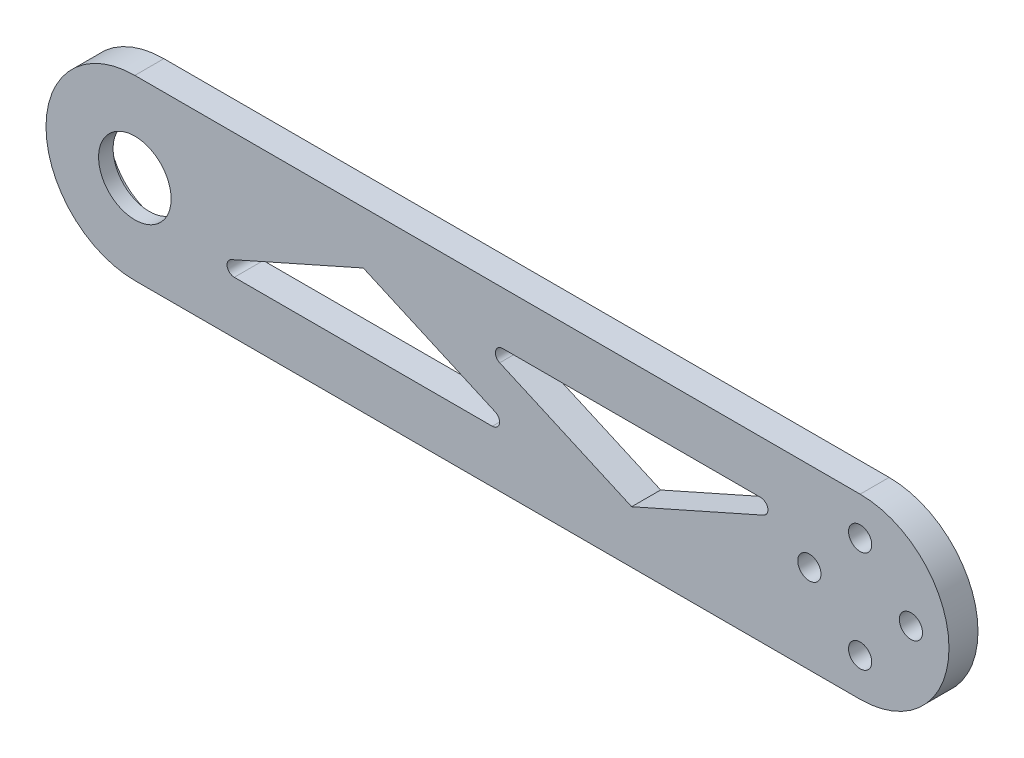
ISO-10303-21;
HEADER;
FILE_DESCRIPTION(('STEP AP214'),'2;1');
FILE_NAME('part.step','',(''),(''),'','','');
FILE_SCHEMA(('AUTOMOTIVE_DESIGN { 1 0 10303 214 1 1 1 1 }'));
ENDSEC;
DATA;
#1=APPLICATION_CONTEXT('core data for automotive mechanical design processes');
#2=APPLICATION_PROTOCOL_DEFINITION('international standard','automotive_design',2000,#1);
#3=PRODUCT_CONTEXT('',#1,'mechanical');
#4=PRODUCT('Part','Part','',(#3));
#5=PRODUCT_RELATED_PRODUCT_CATEGORY('part','',(#4));
#6=PRODUCT_DEFINITION_FORMATION('','',#4);
#7=PRODUCT_DEFINITION_CONTEXT('part definition',#1,'design');
#8=PRODUCT_DEFINITION('design','',#6,#7);
#9=PRODUCT_DEFINITION_SHAPE('','',#8);
#10=(LENGTH_UNIT() NAMED_UNIT(*) SI_UNIT(.MILLI.,.METRE.));
#11=(NAMED_UNIT(*) PLANE_ANGLE_UNIT() SI_UNIT($,.RADIAN.));
#12=(NAMED_UNIT(*) SI_UNIT($,.STERADIAN.) SOLID_ANGLE_UNIT());
#13=UNCERTAINTY_MEASURE_WITH_UNIT(LENGTH_MEASURE(1.E-05),#10,'distance_accuracy_value','');
#14=(GEOMETRIC_REPRESENTATION_CONTEXT(3) GLOBAL_UNCERTAINTY_ASSIGNED_CONTEXT((#13)) GLOBAL_UNIT_ASSIGNED_CONTEXT((#10,
#11,#12)) REPRESENTATION_CONTEXT('',''));
#15=CARTESIAN_POINT('',(0.,0.,0.));
#16=DIRECTION('',(0.,0.,1.));
#17=DIRECTION('',(1.,0.,0.));
#18=AXIS2_PLACEMENT_3D('',#15,#16,#17);
#19=CARTESIAN_POINT('',(0.,0.,4.));
#20=DIRECTION('',(0.,0.,1.));
#21=DIRECTION('',(1.,0.,0.));
#22=AXIS2_PLACEMENT_3D('',#19,#20,#21);
#23=PLANE('',#22);
#24=CARTESIAN_POINT('',(86.287785549551,4.,4.));
#25=DIRECTION('',(0.,0.,1.));
#26=DIRECTION('',(-1.,0.,0.));
#27=AXIS2_PLACEMENT_3D('',#24,#25,#26);
#28=CIRCLE('',#27,1.);
#29=CARTESIAN_POINT('',(86.6939240156043,3.08618845137971,4.));
#30=VERTEX_POINT('',#29);
#31=CARTESIAN_POINT('',(86.2877855495509,5.,4.));
#32=VERTEX_POINT('',#31);
#33=EDGE_CURVE('E59',#30,#32,#28,.T.);
#34=ORIENTED_EDGE('',*,*,#33,.F.);
#35=DIRECTION('',(0.913811548620257,0.406138466053448,0.));
#36=VECTOR('',#35,1.);
#37=CARTESIAN_POINT('',(68.5,-5.,4.));
#38=LINE('',#37,#36);
#39=CARTESIAN_POINT('',(68.5,-5.,4.));
#40=VERTEX_POINT('',#39);
#41=EDGE_CURVE('E154',#40,#30,#38,.T.);
#42=ORIENTED_EDGE('',*,*,#41,.F.);
#43=DIRECTION('',(0.913811548620257,-0.406138466053448,0.));
#44=VECTOR('',#43,1.);
#45=CARTESIAN_POINT('',(50.3060759843957,3.08618845137971,4.));
#46=LINE('',#45,#44);
#47=CARTESIAN_POINT('',(50.3060759843957,3.08618845137971,4.));
#48=VERTEX_POINT('',#47);
#49=EDGE_CURVE('E187',#48,#40,#46,.T.);
#50=ORIENTED_EDGE('',*,*,#49,.F.);
#51=CARTESIAN_POINT('',(50.712214450449,4.,4.));
#52=DIRECTION('',(0.,0.,1.));
#53=DIRECTION('',(1.,0.,0.));
#54=AXIS2_PLACEMENT_3D('',#51,#52,#53);
#55=CIRCLE('',#54,1.);
#56=CARTESIAN_POINT('',(50.7122144504491,5.,4.));
#57=VERTEX_POINT('',#56);
#58=EDGE_CURVE('E183',#57,#48,#55,.T.);
#59=ORIENTED_EDGE('',*,*,#58,.F.);
#60=DIRECTION('',(-1.,0.,0.));
#61=VECTOR('',#60,1.);
#62=CARTESIAN_POINT('',(86.2877855495509,5.,4.));
#63=LINE('',#62,#61);
#64=EDGE_CURVE('E175',#32,#57,#63,.T.);
#65=ORIENTED_EDGE('',*,*,#64,.F.);
#66=EDGE_LOOP('',(#34,#42,#50,#59,#65));
#67=FACE_BOUND('',#66,.T.);
#68=DIRECTION('',(-0.913811548620257,0.406138466053448,0.));
#69=VECTOR('',#68,1.);
#70=CARTESIAN_POINT('',(49.6939240156043,-3.08618845137971,4.));
#71=LINE('',#70,#69);
#72=CARTESIAN_POINT('',(49.6939240156043,-3.08618845137971,4.));
#73=VERTEX_POINT('',#72);
#74=CARTESIAN_POINT('',(31.5,5.,4.));
#75=VERTEX_POINT('',#74);
#76=EDGE_CURVE('E67',#73,#75,#71,.T.);
#77=ORIENTED_EDGE('',*,*,#76,.F.);
#78=CARTESIAN_POINT('',(49.287785549551,-4.,4.));
#79=DIRECTION('',(0.,0.,1.));
#80=DIRECTION('',(1.,0.,0.));
#81=AXIS2_PLACEMENT_3D('',#78,#79,#80);
#82=CIRCLE('',#81,1.);
#83=CARTESIAN_POINT('',(49.2877855495509,-5.,4.));
#84=VERTEX_POINT('',#83);
#85=EDGE_CURVE('E232',#84,#73,#82,.T.);
#86=ORIENTED_EDGE('',*,*,#85,.F.);
#87=DIRECTION('',(1.,0.,0.));
#88=VECTOR('',#87,1.);
#89=CARTESIAN_POINT('',(13.7122144504491,-5.,4.));
#90=LINE('',#89,#88);
#91=CARTESIAN_POINT('',(13.7122144504491,-5.,4.));
#92=VERTEX_POINT('',#91);
#93=EDGE_CURVE('E228',#92,#84,#90,.T.);
#94=ORIENTED_EDGE('',*,*,#93,.F.);
#95=CARTESIAN_POINT('',(13.712214450449,-4.,4.));
#96=DIRECTION('',(0.,0.,1.));
#97=DIRECTION('',(1.,0.,0.));
#98=AXIS2_PLACEMENT_3D('',#95,#96,#97);
#99=CIRCLE('',#98,1.);
#100=CARTESIAN_POINT('',(13.3060759843957,-3.08618845137971,4.));
#101=VERTEX_POINT('',#100);
#102=EDGE_CURVE('E224',#101,#92,#99,.T.);
#103=ORIENTED_EDGE('',*,*,#102,.F.);
#104=DIRECTION('',(-0.913811548620257,-0.406138466053448,0.));
#105=VECTOR('',#104,1.);
#106=CARTESIAN_POINT('',(31.5,5.,4.));
#107=LINE('',#106,#105);
#108=EDGE_CURVE('E220',#75,#101,#107,.T.);
#109=ORIENTED_EDGE('',*,*,#108,.F.);
#110=EDGE_LOOP('',(#77,#86,#94,#103,#109));
#111=FACE_BOUND('',#110,.T.);
#112=CARTESIAN_POINT('',(100.,-6.9999999999986,4.));
#113=DIRECTION('',(0.,0.,1.));
#114=DIRECTION('',(1.,0.,0.));
#115=AXIS2_PLACEMENT_3D('',#112,#113,#114);
#116=CIRCLE('',#115,1.6);
#117=CARTESIAN_POINT('',(101.6,-6.9999999999986,4.));
#118=VERTEX_POINT('',#117);
#119=EDGE_CURVE('E269',#118,#118,#116,.T.);
#120=ORIENTED_EDGE('',*,*,#119,.F.);
#121=EDGE_LOOP('',(#120));
#122=FACE_BOUND('',#121,.T.);
#123=CARTESIAN_POINT('',(100.,7.0000000000014,4.));
#124=DIRECTION('',(0.,0.,1.));
#125=DIRECTION('',(1.,0.,0.));
#126=AXIS2_PLACEMENT_3D('',#123,#124,#125);
#127=CIRCLE('',#126,1.59999999999994);
#128=CARTESIAN_POINT('',(101.6,7.0000000000014,4.));
#129=VERTEX_POINT('',#128);
#130=EDGE_CURVE('E285',#129,#129,#127,.T.);
#131=ORIENTED_EDGE('',*,*,#130,.F.);
#132=EDGE_LOOP('',(#131));
#133=FACE_BOUND('',#132,.T.);
#134=CARTESIAN_POINT('',(0.,0.,4.));
#135=DIRECTION('',(0.,0.,1.));
#136=DIRECTION('',(1.,0.,0.));
#137=AXIS2_PLACEMENT_3D('',#134,#135,#136);
#138=CIRCLE('',#137,12.2500000000014);
#139=CARTESIAN_POINT('',(0.,12.2500000000014,4.));
#140=VERTEX_POINT('',#139);
#141=CARTESIAN_POINT('',(0.,-12.2500000000014,4.));
#142=VERTEX_POINT('',#141);
#143=EDGE_CURVE('E297',#140,#142,#138,.T.);
#144=ORIENTED_EDGE('',*,*,#143,.T.);
#145=DIRECTION('',(1.,0.,0.));
#146=VECTOR('',#145,1.);
#147=CARTESIAN_POINT('',(0.,-12.2500000000014,4.));
#148=LINE('',#147,#146);
#149=CARTESIAN_POINT('',(100.,-12.25,4.));
#150=VERTEX_POINT('',#149);
#151=EDGE_CURVE('E301',#142,#150,#148,.T.);
#152=ORIENTED_EDGE('',*,*,#151,.T.);
#153=CARTESIAN_POINT('',(100.,1.39659253553725E-12,4.));
#154=DIRECTION('',(0.,0.,1.));
#155=DIRECTION('',(1.,0.,0.));
#156=AXIS2_PLACEMENT_3D('',#153,#154,#155);
#157=CIRCLE('',#156,12.2500000000014);
#158=CARTESIAN_POINT('',(100.,12.2500000000014,4.));
#159=VERTEX_POINT('',#158);
#160=EDGE_CURVE('E305',#150,#159,#157,.T.);
#161=ORIENTED_EDGE('',*,*,#160,.T.);
#162=DIRECTION('',(-1.,0.,0.));
#163=VECTOR('',#162,1.);
#164=CARTESIAN_POINT('',(0.,12.2500000000014,4.));
#165=LINE('',#164,#163);
#166=EDGE_CURVE('E308',#159,#140,#165,.T.);
#167=ORIENTED_EDGE('',*,*,#166,.T.);
#168=EDGE_LOOP('',(#144,#152,#161,#167));
#169=FACE_BOUND('',#168,.T.);
#170=CARTESIAN_POINT('',(0.,0.,4.));
#171=DIRECTION('',(0.,0.,1.));
#172=DIRECTION('',(1.,0.,0.));
#173=AXIS2_PLACEMENT_3D('',#170,#171,#172);
#174=CIRCLE('',#173,5.);
#175=CARTESIAN_POINT('',(5.,0.,4.));
#176=VERTEX_POINT('',#175);
#177=EDGE_CURVE('E289',#176,#176,#174,.T.);
#178=ORIENTED_EDGE('',*,*,#177,.F.);
#179=EDGE_LOOP('',(#178));
#180=FACE_BOUND('',#179,.T.);
#181=CARTESIAN_POINT('',(107.,1.47104550762833E-12,4.));
#182=DIRECTION('',(0.,0.,1.));
#183=DIRECTION('',(1.,0.,0.));
#184=AXIS2_PLACEMENT_3D('',#181,#182,#183);
#185=CIRCLE('',#184,1.6);
#186=CARTESIAN_POINT('',(108.6,1.47104550762833E-12,4.));
#187=VERTEX_POINT('',#186);
#188=EDGE_CURVE('E277',#187,#187,#185,.T.);
#189=ORIENTED_EDGE('',*,*,#188,.F.);
#190=EDGE_LOOP('',(#189));
#191=FACE_BOUND('',#190,.T.);
#192=CARTESIAN_POINT('',(93.0000000000001,1.37390099297363E-12,4.));
#193=DIRECTION('',(0.,0.,1.));
#194=DIRECTION('',(1.,0.,0.));
#195=AXIS2_PLACEMENT_3D('',#192,#193,#194);
#196=CIRCLE('',#195,1.60000000000001);
#197=CARTESIAN_POINT('',(94.6000000000001,1.37390099297363E-12,4.));
#198=VERTEX_POINT('',#197);
#199=EDGE_CURVE('E260',#198,#198,#196,.T.);
#200=ORIENTED_EDGE('',*,*,#199,.F.);
#201=EDGE_LOOP('',(#200));
#202=FACE_BOUND('',#201,.T.);
#203=ADVANCED_FACE('F41',(#67,#111,#122,#133,#169,#180,#191,#202),#23,.T.);
#204=CARTESIAN_POINT('',(0.,0.,0.));
#205=DIRECTION('',(0.,0.,1.));
#206=DIRECTION('',(1.,0.,0.));
#207=AXIS2_PLACEMENT_3D('',#204,#205,#206);
#208=PLANE('',#207);
#209=DIRECTION('',(-0.913811548620257,-0.406138466053448,0.));
#210=VECTOR('',#209,1.);
#211=CARTESIAN_POINT('',(68.5,-5.,0.));
#212=LINE('',#211,#210);
#213=CARTESIAN_POINT('',(86.6939240156043,3.08618845137971,0.));
#214=VERTEX_POINT('',#213);
#215=CARTESIAN_POINT('',(68.5,-5.,0.));
#216=VERTEX_POINT('',#215);
#217=EDGE_CURVE('E170',#214,#216,#212,.T.);
#218=ORIENTED_EDGE('',*,*,#217,.F.);
#219=CARTESIAN_POINT('',(86.287785549551,4.,0.));
#220=DIRECTION('',(0.,0.,1.));
#221=DIRECTION('',(1.,0.,0.));
#222=AXIS2_PLACEMENT_3D('',#219,#220,#221);
#223=CIRCLE('',#222,1.);
#224=CARTESIAN_POINT('',(86.2877855495509,5.,0.));
#225=VERTEX_POINT('',#224);
#226=EDGE_CURVE('E147',#225,#214,#223,.F.);
#227=ORIENTED_EDGE('',*,*,#226,.F.);
#228=DIRECTION('',(1.,0.,0.));
#229=VECTOR('',#228,1.);
#230=CARTESIAN_POINT('',(86.2877855495509,5.,0.));
#231=LINE('',#230,#229);
#232=CARTESIAN_POINT('',(50.7122144504491,5.,0.));
#233=VERTEX_POINT('',#232);
#234=EDGE_CURVE('E158',#233,#225,#231,.T.);
#235=ORIENTED_EDGE('',*,*,#234,.F.);
#236=CARTESIAN_POINT('',(50.712214450449,4.,0.));
#237=DIRECTION('',(0.,0.,1.));
#238=DIRECTION('',(1.,0.,0.));
#239=AXIS2_PLACEMENT_3D('',#236,#237,#238);
#240=CIRCLE('',#239,1.);
#241=CARTESIAN_POINT('',(50.3060759843957,3.08618845137971,0.));
#242=VERTEX_POINT('',#241);
#243=EDGE_CURVE('E560',#242,#233,#240,.F.);
#244=ORIENTED_EDGE('',*,*,#243,.F.);
#245=DIRECTION('',(-0.913811548620257,0.406138466053448,0.));
#246=VECTOR('',#245,1.);
#247=CARTESIAN_POINT('',(50.3060759843957,3.08618845137971,0.));
#248=LINE('',#247,#246);
#249=EDGE_CURVE('E177',#216,#242,#248,.T.);
#250=ORIENTED_EDGE('',*,*,#249,.F.);
#251=EDGE_LOOP('',(#218,#227,#235,#244,#250));
#252=FACE_BOUND('',#251,.T.);
#253=CARTESIAN_POINT('',(49.287785549551,-4.,0.));
#254=DIRECTION('',(0.,0.,1.));
#255=DIRECTION('',(1.,0.,0.));
#256=AXIS2_PLACEMENT_3D('',#253,#254,#255);
#257=CIRCLE('',#256,1.);
#258=CARTESIAN_POINT('',(49.6939240156043,-3.08618845137971,0.));
#259=VERTEX_POINT('',#258);
#260=CARTESIAN_POINT('',(49.2877855495509,-5.,0.));
#261=VERTEX_POINT('',#260);
#262=EDGE_CURVE('E210',#259,#261,#257,.F.);
#263=ORIENTED_EDGE('',*,*,#262,.F.);
#264=DIRECTION('',(0.913811548620257,-0.406138466053448,0.));
#265=VECTOR('',#264,1.);
#266=CARTESIAN_POINT('',(49.6939240156043,-3.08618845137971,0.));
#267=LINE('',#266,#265);
#268=CARTESIAN_POINT('',(31.5,5.,0.));
#269=VERTEX_POINT('',#268);
#270=EDGE_CURVE('E214',#269,#259,#267,.T.);
#271=ORIENTED_EDGE('',*,*,#270,.F.);
#272=DIRECTION('',(0.913811548620257,0.406138466053448,0.));
#273=VECTOR('',#272,1.);
#274=CARTESIAN_POINT('',(31.5,5.,0.));
#275=LINE('',#274,#273);
#276=CARTESIAN_POINT('',(13.3060759843957,-3.08618845137971,0.));
#277=VERTEX_POINT('',#276);
#278=EDGE_CURVE('E240',#277,#269,#275,.T.);
#279=ORIENTED_EDGE('',*,*,#278,.F.);
#280=CARTESIAN_POINT('',(13.712214450449,-4.,0.));
#281=DIRECTION('',(0.,0.,1.));
#282=DIRECTION('',(1.,0.,0.));
#283=AXIS2_PLACEMENT_3D('',#280,#281,#282);
#284=CIRCLE('',#283,1.);
#285=CARTESIAN_POINT('',(13.7122144504491,-5.,0.));
#286=VERTEX_POINT('',#285);
#287=EDGE_CURVE('E163',#286,#277,#284,.F.);
#288=ORIENTED_EDGE('',*,*,#287,.F.);
#289=DIRECTION('',(-1.,0.,0.));
#290=VECTOR('',#289,1.);
#291=CARTESIAN_POINT('',(13.7122144504491,-5.,0.));
#292=LINE('',#291,#290);
#293=EDGE_CURVE('E206',#261,#286,#292,.T.);
#294=ORIENTED_EDGE('',*,*,#293,.F.);
#295=EDGE_LOOP('',(#263,#271,#279,#288,#294));
#296=FACE_BOUND('',#295,.T.);
#297=CARTESIAN_POINT('',(0.,0.,0.));
#298=DIRECTION('',(0.,0.,1.));
#299=DIRECTION('',(1.,0.,0.));
#300=AXIS2_PLACEMENT_3D('',#297,#298,#299);
#301=CIRCLE('',#300,7.5);
#302=CARTESIAN_POINT('',(7.5,0.,0.));
#303=VERTEX_POINT('',#302);
#304=EDGE_CURVE('E45',#303,#303,#301,.T.);
#305=ORIENTED_EDGE('',*,*,#304,.T.);
#306=EDGE_LOOP('',(#305));
#307=FACE_BOUND('',#306,.T.);
#308=CARTESIAN_POINT('',(0.,0.,0.));
#309=DIRECTION('',(0.,0.,1.));
#310=DIRECTION('',(1.,0.,0.));
#311=AXIS2_PLACEMENT_3D('',#308,#309,#310);
#312=CIRCLE('',#311,12.2500000000014);
#313=CARTESIAN_POINT('',(0.,12.2500000000014,0.));
#314=VERTEX_POINT('',#313);
#315=CARTESIAN_POINT('',(0.,-12.2500000000014,0.));
#316=VERTEX_POINT('',#315);
#317=EDGE_CURVE('E296',#314,#316,#312,.T.);
#318=ORIENTED_EDGE('',*,*,#317,.F.);
#319=DIRECTION('',(-1.,0.,0.));
#320=VECTOR('',#319,1.);
#321=CARTESIAN_POINT('',(0.,12.2500000000014,0.));
#322=LINE('',#321,#320);
#323=CARTESIAN_POINT('',(100.,12.2500000000014,0.));
#324=VERTEX_POINT('',#323);
#325=EDGE_CURVE('E302',#324,#314,#322,.T.);
#326=ORIENTED_EDGE('',*,*,#325,.F.);
#327=CARTESIAN_POINT('',(100.,1.39659253553725E-12,0.));
#328=DIRECTION('',(0.,0.,1.));
#329=DIRECTION('',(1.,0.,0.));
#330=AXIS2_PLACEMENT_3D('',#327,#328,#329);
#331=CIRCLE('',#330,12.2500000000014);
#332=CARTESIAN_POINT('',(100.,-12.25,0.));
#333=VERTEX_POINT('',#332);
#334=EDGE_CURVE('E318',#333,#324,#331,.T.);
#335=ORIENTED_EDGE('',*,*,#334,.F.);
#336=DIRECTION('',(1.,0.,0.));
#337=VECTOR('',#336,1.);
#338=CARTESIAN_POINT('',(0.,-12.2500000000014,0.));
#339=LINE('',#338,#337);
#340=EDGE_CURVE('E315',#316,#333,#339,.T.);
#341=ORIENTED_EDGE('',*,*,#340,.F.);
#342=EDGE_LOOP('',(#318,#326,#335,#341));
#343=FACE_BOUND('',#342,.T.);
#344=CARTESIAN_POINT('',(100.,7.0000000000014,0.));
#345=DIRECTION('',(0.,0.,1.));
#346=DIRECTION('',(1.,0.,0.));
#347=AXIS2_PLACEMENT_3D('',#344,#345,#346);
#348=CIRCLE('',#347,1.59999999999994);
#349=CARTESIAN_POINT('',(101.6,7.0000000000014,0.));
#350=VERTEX_POINT('',#349);
#351=EDGE_CURVE('E281',#350,#350,#348,.T.);
#352=ORIENTED_EDGE('',*,*,#351,.T.);
#353=EDGE_LOOP('',(#352));
#354=FACE_BOUND('',#353,.T.);
#355=CARTESIAN_POINT('',(107.,1.47104550762833E-12,0.));
#356=DIRECTION('',(0.,0.,1.));
#357=DIRECTION('',(1.,0.,0.));
#358=AXIS2_PLACEMENT_3D('',#355,#356,#357);
#359=CIRCLE('',#358,1.6);
#360=CARTESIAN_POINT('',(108.6,1.47104550762833E-12,0.));
#361=VERTEX_POINT('',#360);
#362=EDGE_CURVE('E273',#361,#361,#359,.T.);
#363=ORIENTED_EDGE('',*,*,#362,.T.);
#364=EDGE_LOOP('',(#363));
#365=FACE_BOUND('',#364,.T.);
#366=CARTESIAN_POINT('',(100.,-6.9999999999986,0.));
#367=DIRECTION('',(0.,0.,1.));
#368=DIRECTION('',(1.,0.,0.));
#369=AXIS2_PLACEMENT_3D('',#366,#367,#368);
#370=CIRCLE('',#369,1.6);
#371=CARTESIAN_POINT('',(101.6,-6.9999999999986,0.));
#372=VERTEX_POINT('',#371);
#373=EDGE_CURVE('E264',#372,#372,#370,.T.);
#374=ORIENTED_EDGE('',*,*,#373,.T.);
#375=EDGE_LOOP('',(#374));
#376=FACE_BOUND('',#375,.T.);
#377=CARTESIAN_POINT('',(93.0000000000001,1.37390099297363E-12,0.));
#378=DIRECTION('',(0.,0.,1.));
#379=DIRECTION('',(1.,0.,0.));
#380=AXIS2_PLACEMENT_3D('',#377,#378,#379);
#381=CIRCLE('',#380,1.60000000000001);
#382=CARTESIAN_POINT('',(94.6000000000001,1.37390099297363E-12,0.));
#383=VERTEX_POINT('',#382);
#384=EDGE_CURVE('E265',#383,#383,#381,.T.);
#385=ORIENTED_EDGE('',*,*,#384,.T.);
#386=EDGE_LOOP('',(#385));
#387=FACE_BOUND('',#386,.T.);
#388=ADVANCED_FACE('F166',(#252,#296,#307,#343,#354,#365,#376,#387),#208,.F.);
#389=CARTESIAN_POINT('',(0.,0.,4.));
#390=DIRECTION('',(0.,0.,-1.));
#391=DIRECTION('',(-1.,0.,0.));
#392=AXIS2_PLACEMENT_3D('',#389,#390,#391);
#393=CYLINDRICAL_SURFACE('',#392,12.2500000000014);
#394=ORIENTED_EDGE('',*,*,#317,.T.);
#395=DIRECTION('',(0.,0.,-1.));
#396=VECTOR('',#395,1.);
#397=CARTESIAN_POINT('',(0.,-12.2500000000014,4.));
#398=LINE('',#397,#396);
#399=EDGE_CURVE('E11',#142,#316,#398,.T.);
#400=ORIENTED_EDGE('',*,*,#399,.F.);
#401=ORIENTED_EDGE('',*,*,#143,.F.);
#402=DIRECTION('',(0.,0.,-1.));
#403=VECTOR('',#402,1.);
#404=CARTESIAN_POINT('',(0.,12.2500000000014,4.));
#405=LINE('',#404,#403);
#406=EDGE_CURVE('E311',#140,#314,#405,.T.);
#407=ORIENTED_EDGE('',*,*,#406,.T.);
#408=EDGE_LOOP('',(#394,#400,#401,#407));
#409=FACE_BOUND('',#408,.T.);
#410=ADVANCED_FACE('F43',(#409),#393,.T.);
#411=CARTESIAN_POINT('',(0.,-12.2500000000014,4.));
#412=DIRECTION('',(0.,1.,0.));
#413=DIRECTION('',(0.,0.,1.));
#414=AXIS2_PLACEMENT_3D('',#411,#412,#413);
#415=PLANE('',#414);
#416=ORIENTED_EDGE('',*,*,#340,.T.);
#417=DIRECTION('',(0.,0.,-1.));
#418=VECTOR('',#417,1.);
#419=CARTESIAN_POINT('',(100.,-12.25,4.));
#420=LINE('',#419,#418);
#421=EDGE_CURVE('E51',#150,#333,#420,.T.);
#422=ORIENTED_EDGE('',*,*,#421,.F.);
#423=ORIENTED_EDGE('',*,*,#151,.F.);
#424=ORIENTED_EDGE('',*,*,#399,.T.);
#425=EDGE_LOOP('',(#416,#422,#423,#424));
#426=FACE_BOUND('',#425,.T.);
#427=ADVANCED_FACE('F375',(#426),#415,.F.);
#428=CARTESIAN_POINT('',(100.,1.39659253553725E-12,4.));
#429=DIRECTION('',(0.,0.,-1.));
#430=DIRECTION('',(-1.,0.,0.));
#431=AXIS2_PLACEMENT_3D('',#428,#429,#430);
#432=CYLINDRICAL_SURFACE('',#431,12.2500000000014);
#433=ORIENTED_EDGE('',*,*,#334,.T.);
#434=DIRECTION('',(0.,0.,-1.));
#435=VECTOR('',#434,1.);
#436=CARTESIAN_POINT('',(100.,12.2500000000014,4.));
#437=LINE('',#436,#435);
#438=EDGE_CURVE('E326',#159,#324,#437,.T.);
#439=ORIENTED_EDGE('',*,*,#438,.F.);
#440=ORIENTED_EDGE('',*,*,#160,.F.);
#441=ORIENTED_EDGE('',*,*,#421,.T.);
#442=EDGE_LOOP('',(#433,#439,#440,#441));
#443=FACE_BOUND('',#442,.T.);
#444=ADVANCED_FACE('F372',(#443),#432,.T.);
#445=CARTESIAN_POINT('',(0.,12.2500000000014,4.));
#446=DIRECTION('',(0.,-1.,0.));
#447=DIRECTION('',(0.,0.,-1.));
#448=AXIS2_PLACEMENT_3D('',#445,#446,#447);
#449=PLANE('',#448);
#450=ORIENTED_EDGE('',*,*,#325,.T.);
#451=ORIENTED_EDGE('',*,*,#406,.F.);
#452=ORIENTED_EDGE('',*,*,#166,.F.);
#453=ORIENTED_EDGE('',*,*,#438,.T.);
#454=EDGE_LOOP('',(#450,#451,#452,#453));
#455=FACE_BOUND('',#454,.T.);
#456=ADVANCED_FACE('F369',(#455),#449,.F.);
#457=CARTESIAN_POINT('',(0.,0.,4.));
#458=DIRECTION('',(0.,0.,-1.));
#459=DIRECTION('',(-1.,0.,0.));
#460=AXIS2_PLACEMENT_3D('',#457,#458,#459);
#461=CYLINDRICAL_SURFACE('',#460,5.);
#462=CARTESIAN_POINT('',(0.,0.,2.));
#463=DIRECTION('',(0.,0.,1.));
#464=DIRECTION('',(1.,0.,0.));
#465=AXIS2_PLACEMENT_3D('',#462,#463,#464);
#466=CIRCLE('',#465,5.);
#467=CARTESIAN_POINT('',(5.,0.,2.));
#468=VERTEX_POINT('',#467);
#469=EDGE_CURVE('E259',#468,#468,#466,.T.);
#470=ORIENTED_EDGE('',*,*,#469,.F.);
#471=EDGE_LOOP('',(#470));
#472=FACE_BOUND('',#471,.T.);
#473=ORIENTED_EDGE('',*,*,#177,.T.);
#474=EDGE_LOOP('',(#473));
#475=FACE_BOUND('',#474,.T.);
#476=ADVANCED_FACE('F366',(#472,#475),#461,.F.);
#477=CARTESIAN_POINT('',(100.,7.0000000000014,4.));
#478=DIRECTION('',(0.,0.,-1.));
#479=DIRECTION('',(-1.,0.,0.));
#480=AXIS2_PLACEMENT_3D('',#477,#478,#479);
#481=CYLINDRICAL_SURFACE('',#480,1.59999999999994);
#482=ORIENTED_EDGE('',*,*,#130,.T.);
#483=EDGE_LOOP('',(#482));
#484=FACE_BOUND('',#483,.T.);
#485=ORIENTED_EDGE('',*,*,#351,.F.);
#486=EDGE_LOOP('',(#485));
#487=FACE_BOUND('',#486,.T.);
#488=ADVANCED_FACE('F408',(#484,#487),#481,.F.);
#489=CARTESIAN_POINT('',(107.,1.47104550762833E-12,4.));
#490=DIRECTION('',(0.,0.,-1.));
#491=DIRECTION('',(-1.,0.,0.));
#492=AXIS2_PLACEMENT_3D('',#489,#490,#491);
#493=CYLINDRICAL_SURFACE('',#492,1.6);
#494=ORIENTED_EDGE('',*,*,#188,.T.);
#495=EDGE_LOOP('',(#494));
#496=FACE_BOUND('',#495,.T.);
#497=ORIENTED_EDGE('',*,*,#362,.F.);
#498=EDGE_LOOP('',(#497));
#499=FACE_BOUND('',#498,.T.);
#500=ADVANCED_FACE('F405',(#496,#499),#493,.F.);
#501=CARTESIAN_POINT('',(100.,-6.9999999999986,4.));
#502=DIRECTION('',(0.,0.,-1.));
#503=DIRECTION('',(-1.,0.,0.));
#504=AXIS2_PLACEMENT_3D('',#501,#502,#503);
#505=CYLINDRICAL_SURFACE('',#504,1.6);
#506=ORIENTED_EDGE('',*,*,#119,.T.);
#507=EDGE_LOOP('',(#506));
#508=FACE_BOUND('',#507,.T.);
#509=ORIENTED_EDGE('',*,*,#373,.F.);
#510=EDGE_LOOP('',(#509));
#511=FACE_BOUND('',#510,.T.);
#512=ADVANCED_FACE('F354',(#508,#511),#505,.F.);
#513=CARTESIAN_POINT('',(93.0000000000001,1.37390099297363E-12,4.));
#514=DIRECTION('',(0.,0.,-1.));
#515=DIRECTION('',(-1.,0.,0.));
#516=AXIS2_PLACEMENT_3D('',#513,#514,#515);
#517=CYLINDRICAL_SURFACE('',#516,1.60000000000001);
#518=ORIENTED_EDGE('',*,*,#199,.T.);
#519=EDGE_LOOP('',(#518));
#520=FACE_BOUND('',#519,.T.);
#521=ORIENTED_EDGE('',*,*,#384,.F.);
#522=EDGE_LOOP('',(#521));
#523=FACE_BOUND('',#522,.T.);
#524=ADVANCED_FACE('F345',(#520,#523),#517,.F.);
#525=CARTESIAN_POINT('',(0.,0.,-1.));
#526=DIRECTION('',(0.,0.,1.));
#527=DIRECTION('',(1.,0.,0.));
#528=AXIS2_PLACEMENT_3D('',#525,#526,#527);
#529=CYLINDRICAL_SURFACE('',#528,7.5);
#530=CARTESIAN_POINT('',(0.,0.,2.));
#531=DIRECTION('',(0.,0.,1.));
#532=DIRECTION('',(1.,0.,0.));
#533=AXIS2_PLACEMENT_3D('',#530,#531,#532);
#534=CIRCLE('',#533,7.5);
#535=CARTESIAN_POINT('',(7.5,0.,2.));
#536=VERTEX_POINT('',#535);
#537=EDGE_CURVE('E255',#536,#536,#534,.T.);
#538=ORIENTED_EDGE('',*,*,#537,.T.);
#539=EDGE_LOOP('',(#538));
#540=FACE_BOUND('',#539,.T.);
#541=ORIENTED_EDGE('',*,*,#304,.F.);
#542=EDGE_LOOP('',(#541));
#543=FACE_BOUND('',#542,.T.);
#544=ADVANCED_FACE('F342',(#540,#543),#529,.F.);
#545=CARTESIAN_POINT('',(0.,0.,2.));
#546=DIRECTION('',(0.,0.,1.));
#547=DIRECTION('',(1.,0.,0.));
#548=AXIS2_PLACEMENT_3D('',#545,#546,#547);
#549=PLANE('',#548);
#550=ORIENTED_EDGE('',*,*,#469,.T.);
#551=EDGE_LOOP('',(#550));
#552=FACE_BOUND('',#551,.T.);
#553=ORIENTED_EDGE('',*,*,#537,.F.);
#554=EDGE_LOOP('',(#553));
#555=FACE_BOUND('',#554,.T.);
#556=ADVANCED_FACE('F344',(#552,#555),#549,.F.);
#557=CARTESIAN_POINT('',(49.6939240156043,-3.08618845137971,-0.00100000000000013));
#558=DIRECTION('',(0.406138466053448,0.913811548620257,0.));
#559=DIRECTION('',(-0.913811548620257,0.406138466053448,0.));
#560=AXIS2_PLACEMENT_3D('',#557,#558,#559);
#561=PLANE('',#560);
#562=ORIENTED_EDGE('',*,*,#270,.T.);
#563=DIRECTION('',(0.,0.,1.));
#564=VECTOR('',#563,1.);
#565=CARTESIAN_POINT('',(49.6939240156043,-3.08618845137971,-0.00100000000000013));
#566=LINE('',#565,#564);
#567=EDGE_CURVE('E237',#259,#73,#566,.T.);
#568=ORIENTED_EDGE('',*,*,#567,.T.);
#569=ORIENTED_EDGE('',*,*,#76,.T.);
#570=DIRECTION('',(0.,0.,1.));
#571=VECTOR('',#570,1.);
#572=CARTESIAN_POINT('',(31.5,5.,-0.00100000000000013));
#573=LINE('',#572,#571);
#574=EDGE_CURVE('E236',#269,#75,#573,.T.);
#575=ORIENTED_EDGE('',*,*,#574,.F.);
#576=EDGE_LOOP('',(#562,#568,#569,#575));
#577=FACE_BOUND('',#576,.T.);
#578=ADVANCED_FACE('F352',(#577),#561,.F.);
#579=CARTESIAN_POINT('',(49.287785549551,-4.,-0.00100000000000013));
#580=DIRECTION('',(0.,0.,1.));
#581=DIRECTION('',(1.,0.,0.));
#582=AXIS2_PLACEMENT_3D('',#579,#580,#581);
#583=CYLINDRICAL_SURFACE('',#582,1.);
#584=ORIENTED_EDGE('',*,*,#262,.T.);
#585=DIRECTION('',(0.,0.,1.));
#586=VECTOR('',#585,1.);
#587=CARTESIAN_POINT('',(49.2877855495509,-5.,-0.00100000000000013));
#588=LINE('',#587,#586);
#589=EDGE_CURVE('E241',#261,#84,#588,.T.);
#590=ORIENTED_EDGE('',*,*,#589,.T.);
#591=ORIENTED_EDGE('',*,*,#85,.T.);
#592=ORIENTED_EDGE('',*,*,#567,.F.);
#593=EDGE_LOOP('',(#584,#590,#591,#592));
#594=FACE_BOUND('',#593,.T.);
#595=ADVANCED_FACE('F470',(#594),#583,.F.);
#596=CARTESIAN_POINT('',(13.7122144504491,-5.,-0.00100000000000013));
#597=DIRECTION('',(0.,-1.,0.));
#598=DIRECTION('',(0.,0.,-1.));
#599=AXIS2_PLACEMENT_3D('',#596,#597,#598);
#600=PLANE('',#599);
#601=ORIENTED_EDGE('',*,*,#293,.T.);
#602=DIRECTION('',(0.,0.,1.));
#603=VECTOR('',#602,1.);
#604=CARTESIAN_POINT('',(13.7122144504491,-5.,-0.00100000000000013));
#605=LINE('',#604,#603);
#606=EDGE_CURVE('E244',#286,#92,#605,.T.);
#607=ORIENTED_EDGE('',*,*,#606,.T.);
#608=ORIENTED_EDGE('',*,*,#93,.T.);
#609=ORIENTED_EDGE('',*,*,#589,.F.);
#610=EDGE_LOOP('',(#601,#607,#608,#609));
#611=FACE_BOUND('',#610,.T.);
#612=ADVANCED_FACE('F480',(#611),#600,.F.);
#613=CARTESIAN_POINT('',(13.712214450449,-4.,-0.00100000000000013));
#614=DIRECTION('',(0.,0.,1.));
#615=DIRECTION('',(1.,0.,0.));
#616=AXIS2_PLACEMENT_3D('',#613,#614,#615);
#617=CYLINDRICAL_SURFACE('',#616,1.);
#618=ORIENTED_EDGE('',*,*,#287,.T.);
#619=DIRECTION('',(0.,0.,1.));
#620=VECTOR('',#619,1.);
#621=CARTESIAN_POINT('',(13.3060759843957,-3.08618845137971,-0.00100000000000013));
#622=LINE('',#621,#620);
#623=EDGE_CURVE('E247',#277,#101,#622,.T.);
#624=ORIENTED_EDGE('',*,*,#623,.T.);
#625=ORIENTED_EDGE('',*,*,#102,.T.);
#626=ORIENTED_EDGE('',*,*,#606,.F.);
#627=EDGE_LOOP('',(#618,#624,#625,#626));
#628=FACE_BOUND('',#627,.T.);
#629=ADVANCED_FACE('F490',(#628),#617,.F.);
#630=CARTESIAN_POINT('',(31.5,5.,-0.00100000000000013));
#631=DIRECTION('',(-0.406138466053448,0.913811548620257,0.));
#632=DIRECTION('',(-0.913811548620257,-0.406138466053448,0.));
#633=AXIS2_PLACEMENT_3D('',#630,#631,#632);
#634=PLANE('',#633);
#635=ORIENTED_EDGE('',*,*,#278,.T.);
#636=ORIENTED_EDGE('',*,*,#574,.T.);
#637=ORIENTED_EDGE('',*,*,#108,.T.);
#638=ORIENTED_EDGE('',*,*,#623,.F.);
#639=EDGE_LOOP('',(#635,#636,#637,#638));
#640=FACE_BOUND('',#639,.T.);
#641=ADVANCED_FACE('F500',(#640),#634,.F.);
#642=CARTESIAN_POINT('',(86.287785549551,4.,-0.00100000000000013));
#643=DIRECTION('',(0.,0.,1.));
#644=DIRECTION('',(1.,0.,0.));
#645=AXIS2_PLACEMENT_3D('',#642,#643,#644);
#646=CYLINDRICAL_SURFACE('',#645,1.);
#647=ORIENTED_EDGE('',*,*,#226,.T.);
#648=DIRECTION('',(0.,0.,1.));
#649=VECTOR('',#648,1.);
#650=CARTESIAN_POINT('',(86.6939240156043,3.08618845137971,-0.00100000000000013));
#651=LINE('',#650,#649);
#652=EDGE_CURVE('E164',#214,#30,#651,.T.);
#653=ORIENTED_EDGE('',*,*,#652,.T.);
#654=ORIENTED_EDGE('',*,*,#33,.T.);
#655=DIRECTION('',(0.,0.,1.));
#656=VECTOR('',#655,1.);
#657=CARTESIAN_POINT('',(86.2877855495509,5.,-0.00100000000000013));
#658=LINE('',#657,#656);
#659=EDGE_CURVE('E143',#225,#32,#658,.T.);
#660=ORIENTED_EDGE('',*,*,#659,.F.);
#661=EDGE_LOOP('',(#647,#653,#654,#660));
#662=FACE_BOUND('',#661,.T.);
#663=ADVANCED_FACE('F145',(#662),#646,.F.);
#664=CARTESIAN_POINT('',(68.5,-5.,-0.00100000000000013));
#665=DIRECTION('',(0.406138466053448,-0.913811548620257,0.));
#666=DIRECTION('',(0.913811548620257,0.406138466053448,0.));
#667=AXIS2_PLACEMENT_3D('',#664,#665,#666);
#668=PLANE('',#667);
#669=ORIENTED_EDGE('',*,*,#217,.T.);
#670=DIRECTION('',(0.,0.,1.));
#671=VECTOR('',#670,1.);
#672=CARTESIAN_POINT('',(68.5,-5.,-0.00100000000000013));
#673=LINE('',#672,#671);
#674=EDGE_CURVE('E196',#216,#40,#673,.T.);
#675=ORIENTED_EDGE('',*,*,#674,.T.);
#676=ORIENTED_EDGE('',*,*,#41,.T.);
#677=ORIENTED_EDGE('',*,*,#652,.F.);
#678=EDGE_LOOP('',(#669,#675,#676,#677));
#679=FACE_BOUND('',#678,.T.);
#680=ADVANCED_FACE('F519',(#679),#668,.F.);
#681=CARTESIAN_POINT('',(50.3060759843957,3.08618845137971,-0.00100000000000013));
#682=DIRECTION('',(-0.406138466053448,-0.913811548620257,0.));
#683=DIRECTION('',(0.913811548620257,-0.406138466053448,0.));
#684=AXIS2_PLACEMENT_3D('',#681,#682,#683);
#685=PLANE('',#684);
#686=ORIENTED_EDGE('',*,*,#249,.T.);
#687=DIRECTION('',(0.,0.,1.));
#688=VECTOR('',#687,1.);
#689=CARTESIAN_POINT('',(50.3060759843957,3.08618845137971,-0.00100000000000013));
#690=LINE('',#689,#688);
#691=EDGE_CURVE('E199',#242,#48,#690,.T.);
#692=ORIENTED_EDGE('',*,*,#691,.T.);
#693=ORIENTED_EDGE('',*,*,#49,.T.);
#694=ORIENTED_EDGE('',*,*,#674,.F.);
#695=EDGE_LOOP('',(#686,#692,#693,#694));
#696=FACE_BOUND('',#695,.T.);
#697=ADVANCED_FACE('F528',(#696),#685,.F.);
#698=CARTESIAN_POINT('',(50.712214450449,4.,-0.00100000000000013));
#699=DIRECTION('',(0.,0.,1.));
#700=DIRECTION('',(1.,0.,0.));
#701=AXIS2_PLACEMENT_3D('',#698,#699,#700);
#702=CYLINDRICAL_SURFACE('',#701,1.);
#703=ORIENTED_EDGE('',*,*,#243,.T.);
#704=DIRECTION('',(0.,0.,1.));
#705=VECTOR('',#704,1.);
#706=CARTESIAN_POINT('',(50.7122144504491,5.,-0.00100000000000013));
#707=LINE('',#706,#705);
#708=EDGE_CURVE('E153',#233,#57,#707,.T.);
#709=ORIENTED_EDGE('',*,*,#708,.T.);
#710=ORIENTED_EDGE('',*,*,#58,.T.);
#711=ORIENTED_EDGE('',*,*,#691,.F.);
#712=EDGE_LOOP('',(#703,#709,#710,#711));
#713=FACE_BOUND('',#712,.T.);
#714=ADVANCED_FACE('F538',(#713),#702,.F.);
#715=CARTESIAN_POINT('',(86.2877855495509,5.,-0.00100000000000013));
#716=DIRECTION('',(0.,1.,0.));
#717=DIRECTION('',(0.,0.,1.));
#718=AXIS2_PLACEMENT_3D('',#715,#716,#717);
#719=PLANE('',#718);
#720=ORIENTED_EDGE('',*,*,#234,.T.);
#721=ORIENTED_EDGE('',*,*,#659,.T.);
#722=ORIENTED_EDGE('',*,*,#64,.T.);
#723=ORIENTED_EDGE('',*,*,#708,.F.);
#724=EDGE_LOOP('',(#720,#721,#722,#723));
#725=FACE_BOUND('',#724,.T.);
#726=ADVANCED_FACE('F159',(#725),#719,.F.);
#727=CLOSED_SHELL('',(#203,#388,#410,#427,#444,#456,#476,#488,#500,#512,#524,#544,#556,#578,
#595,#612,#629,#641,#663,#680,#697,#714,#726));
#728=MANIFOLD_SOLID_BREP('B2',#727);
#729=ADVANCED_BREP_SHAPE_REPRESENTATION('',(#18,#728),#14);
#730=SHAPE_DEFINITION_REPRESENTATION(#9,#729);
ENDSEC;
END-ISO-10303-21;
